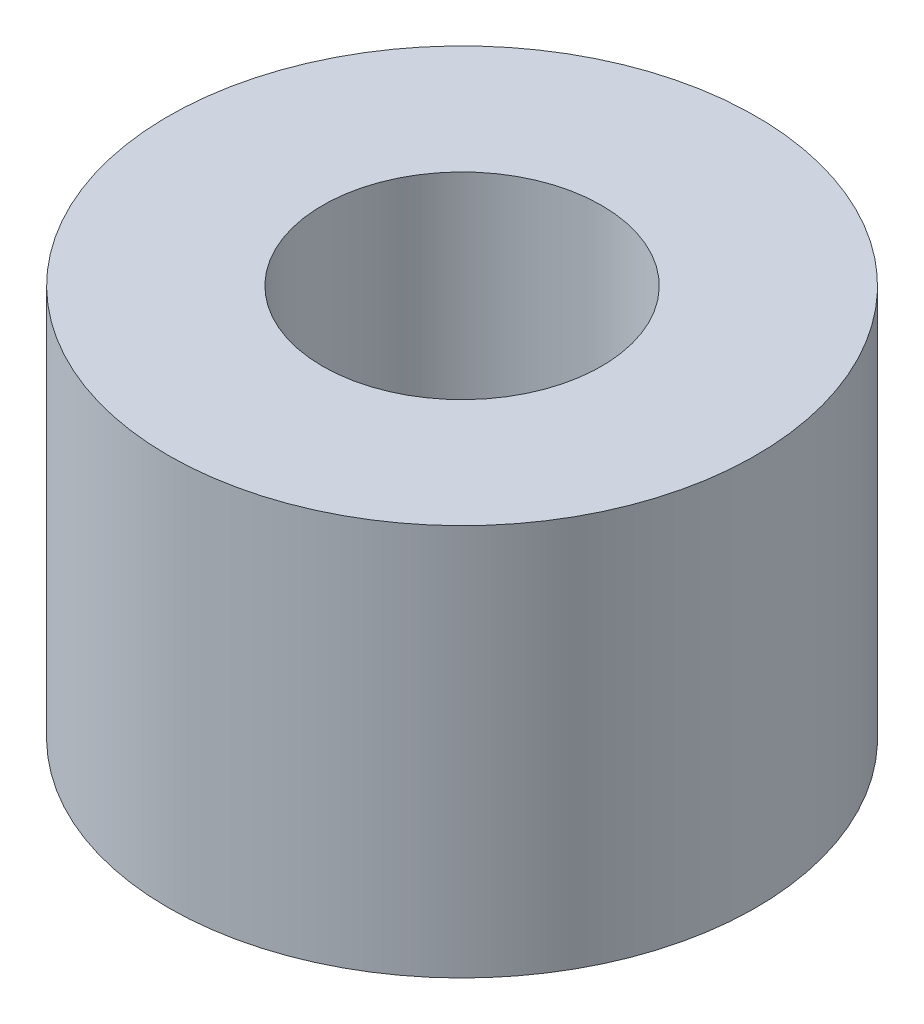
ISO-10303-21;
HEADER;
FILE_DESCRIPTION(('STEP AP214'),'2;1');
FILE_NAME('part.step','',(''),(''),'','','');
FILE_SCHEMA(('AUTOMOTIVE_DESIGN { 1 0 10303 214 1 1 1 1 }'));
ENDSEC;
DATA;
#1=APPLICATION_CONTEXT('core data for automotive mechanical design processes');
#2=APPLICATION_PROTOCOL_DEFINITION('international standard','automotive_design',2000,#1);
#3=PRODUCT_CONTEXT('',#1,'mechanical');
#4=PRODUCT('Part','Part','',(#3));
#5=PRODUCT_RELATED_PRODUCT_CATEGORY('part','',(#4));
#6=PRODUCT_DEFINITION_FORMATION('','',#4);
#7=PRODUCT_DEFINITION_CONTEXT('part definition',#1,'design');
#8=PRODUCT_DEFINITION('design','',#6,#7);
#9=PRODUCT_DEFINITION_SHAPE('','',#8);
#10=(LENGTH_UNIT() NAMED_UNIT(*) SI_UNIT(.MILLI.,.METRE.));
#11=(NAMED_UNIT(*) PLANE_ANGLE_UNIT() SI_UNIT($,.RADIAN.));
#12=(NAMED_UNIT(*) SI_UNIT($,.STERADIAN.) SOLID_ANGLE_UNIT());
#13=UNCERTAINTY_MEASURE_WITH_UNIT(LENGTH_MEASURE(1.E-05),#10,'distance_accuracy_value','');
#14=(GEOMETRIC_REPRESENTATION_CONTEXT(3) GLOBAL_UNCERTAINTY_ASSIGNED_CONTEXT((#13)) GLOBAL_UNIT_ASSIGNED_CONTEXT((#10,
#11,#12)) REPRESENTATION_CONTEXT('',''));
#15=CARTESIAN_POINT('',(0.,0.,0.));
#16=DIRECTION('',(0.,0.,1.));
#17=DIRECTION('',(1.,0.,0.));
#18=AXIS2_PLACEMENT_3D('',#15,#16,#17);
#19=CARTESIAN_POINT('',(0.,3.175,0.));
#20=DIRECTION('',(0.,-1.,0.));
#21=DIRECTION('',(0.,0.,-1.));
#22=AXIS2_PLACEMENT_3D('',#19,#20,#21);
#23=CYLINDRICAL_SURFACE('',#22,2.38125);
#24=CARTESIAN_POINT('',(0.,3.175,0.));
#25=DIRECTION('',(0.,1.,0.));
#26=DIRECTION('',(0.,0.,1.));
#27=AXIS2_PLACEMENT_3D('',#24,#25,#26);
#28=CIRCLE('',#27,2.38125);
#29=CARTESIAN_POINT('',(0.,3.175,2.38125));
#30=VERTEX_POINT('',#29);
#31=EDGE_CURVE('E10',#30,#30,#28,.T.);
#32=ORIENTED_EDGE('',*,*,#31,.F.);
#33=EDGE_LOOP('',(#32));
#34=FACE_BOUND('',#33,.T.);
#35=CARTESIAN_POINT('',(0.,0.,0.));
#36=DIRECTION('',(0.,1.,0.));
#37=DIRECTION('',(0.,0.,1.));
#38=AXIS2_PLACEMENT_3D('',#35,#36,#37);
#39=CIRCLE('',#38,2.38125);
#40=CARTESIAN_POINT('',(0.,0.,2.38125));
#41=VERTEX_POINT('',#40);
#42=EDGE_CURVE('E37',#41,#41,#39,.T.);
#43=ORIENTED_EDGE('',*,*,#42,.T.);
#44=EDGE_LOOP('',(#43));
#45=FACE_BOUND('',#44,.T.);
#46=ADVANCED_FACE('F30',(#34,#45),#23,.T.);
#47=CARTESIAN_POINT('',(0.,3.175,0.));
#48=DIRECTION('',(0.,1.,0.));
#49=DIRECTION('',(0.,0.,1.));
#50=AXIS2_PLACEMENT_3D('',#47,#48,#49);
#51=PLANE('',#50);
#52=CARTESIAN_POINT('',(0.,3.175,0.));
#53=DIRECTION('',(0.,1.,0.));
#54=DIRECTION('',(0.,0.,1.));
#55=AXIS2_PLACEMENT_3D('',#52,#53,#54);
#56=CIRCLE('',#55,1.13029999999999);
#57=CARTESIAN_POINT('',(0.,3.175,1.13029999999999));
#58=VERTEX_POINT('',#57);
#59=EDGE_CURVE('E43',#58,#58,#56,.T.);
#60=ORIENTED_EDGE('',*,*,#59,.F.);
#61=EDGE_LOOP('',(#60));
#62=FACE_BOUND('',#61,.T.);
#63=ORIENTED_EDGE('',*,*,#31,.T.);
#64=EDGE_LOOP('',(#63));
#65=FACE_BOUND('',#64,.T.);
#66=ADVANCED_FACE('F59',(#62,#65),#51,.T.);
#67=CARTESIAN_POINT('',(0.,0.,0.));
#68=DIRECTION('',(0.,1.,0.));
#69=DIRECTION('',(0.,0.,1.));
#70=AXIS2_PLACEMENT_3D('',#67,#68,#69);
#71=PLANE('',#70);
#72=CARTESIAN_POINT('',(0.,0.,0.));
#73=DIRECTION('',(0.,1.,0.));
#74=DIRECTION('',(0.,0.,1.));
#75=AXIS2_PLACEMENT_3D('',#72,#73,#74);
#76=CIRCLE('',#75,1.13029999999999);
#77=CARTESIAN_POINT('',(0.,0.,1.13029999999999));
#78=VERTEX_POINT('',#77);
#79=EDGE_CURVE('E33',#78,#78,#76,.T.);
#80=ORIENTED_EDGE('',*,*,#79,.T.);
#81=EDGE_LOOP('',(#80));
#82=FACE_BOUND('',#81,.T.);
#83=ORIENTED_EDGE('',*,*,#42,.F.);
#84=EDGE_LOOP('',(#83));
#85=FACE_BOUND('',#84,.T.);
#86=ADVANCED_FACE('F50',(#82,#85),#71,.F.);
#87=CARTESIAN_POINT('',(0.,3.175,0.));
#88=DIRECTION('',(0.,1.,0.));
#89=DIRECTION('',(0.,0.,1.));
#90=AXIS2_PLACEMENT_3D('',#87,#88,#89);
#91=CYLINDRICAL_SURFACE('',#90,1.13029999999999);
#92=ORIENTED_EDGE('',*,*,#59,.T.);
#93=EDGE_LOOP('',(#92));
#94=FACE_BOUND('',#93,.T.);
#95=ORIENTED_EDGE('',*,*,#79,.F.);
#96=EDGE_LOOP('',(#95));
#97=FACE_BOUND('',#96,.T.);
#98=ADVANCED_FACE('F53',(#94,#97),#91,.F.);
#99=CLOSED_SHELL('',(#46,#66,#86,#98));
#100=MANIFOLD_SOLID_BREP('B2',#99);
#101=ADVANCED_BREP_SHAPE_REPRESENTATION('',(#18,#100),#14);
#102=SHAPE_DEFINITION_REPRESENTATION(#9,#101);
ENDSEC;
END-ISO-10303-21;
